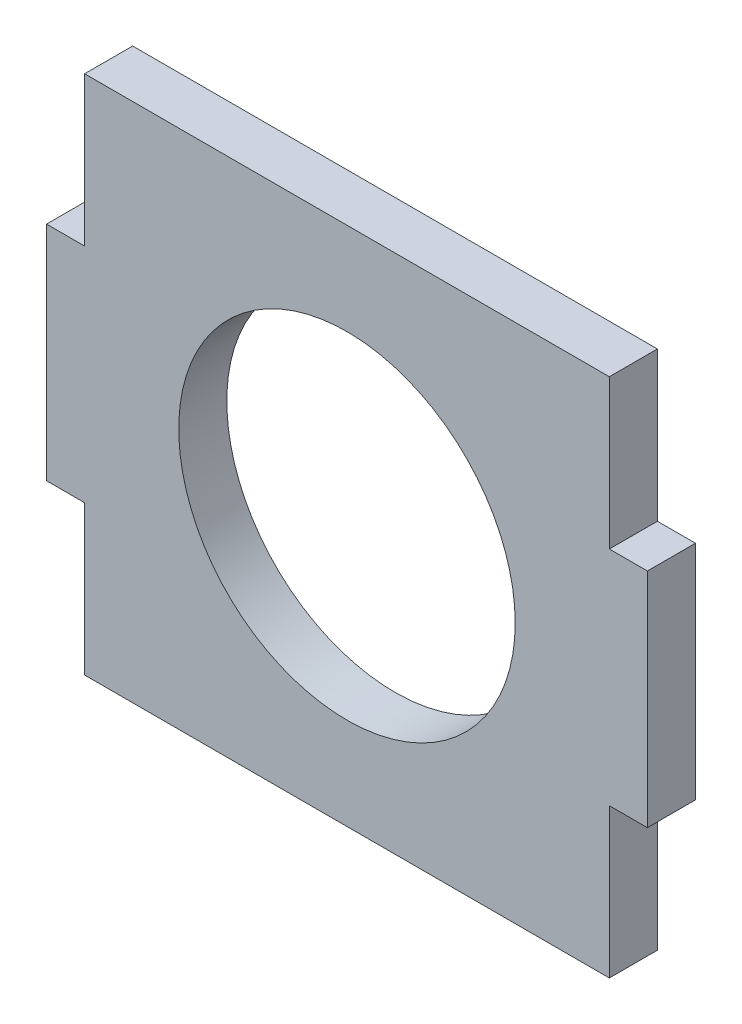
ISO-10303-21;
HEADER;
FILE_DESCRIPTION(('STEP AP214'),'2;1');
FILE_NAME('part.step','',(''),(''),'','','');
FILE_SCHEMA(('AUTOMOTIVE_DESIGN { 1 0 10303 214 1 1 1 1 }'));
ENDSEC;
DATA;
#1=APPLICATION_CONTEXT('core data for automotive mechanical design processes');
#2=APPLICATION_PROTOCOL_DEFINITION('international standard','automotive_design',2000,#1);
#3=PRODUCT_CONTEXT('',#1,'mechanical');
#4=PRODUCT('Part','Part','',(#3));
#5=PRODUCT_RELATED_PRODUCT_CATEGORY('part','',(#4));
#6=PRODUCT_DEFINITION_FORMATION('','',#4);
#7=PRODUCT_DEFINITION_CONTEXT('part definition',#1,'design');
#8=PRODUCT_DEFINITION('design','',#6,#7);
#9=PRODUCT_DEFINITION_SHAPE('','',#8);
#10=(LENGTH_UNIT() NAMED_UNIT(*) SI_UNIT(.MILLI.,.METRE.));
#11=(NAMED_UNIT(*) PLANE_ANGLE_UNIT() SI_UNIT($,.RADIAN.));
#12=(NAMED_UNIT(*) SI_UNIT($,.STERADIAN.) SOLID_ANGLE_UNIT());
#13=UNCERTAINTY_MEASURE_WITH_UNIT(LENGTH_MEASURE(1.E-05),#10,'distance_accuracy_value','');
#14=(GEOMETRIC_REPRESENTATION_CONTEXT(3) GLOBAL_UNCERTAINTY_ASSIGNED_CONTEXT((#13)) GLOBAL_UNIT_ASSIGNED_CONTEXT((#10,
#11,#12)) REPRESENTATION_CONTEXT('',''));
#15=CARTESIAN_POINT('',(0.,0.,0.));
#16=DIRECTION('',(0.,0.,1.));
#17=DIRECTION('',(1.,0.,0.));
#18=AXIS2_PLACEMENT_3D('',#15,#16,#17);
#19=CARTESIAN_POINT('',(-7.5,6.5,1.2));
#20=DIRECTION('',(1.,0.,0.));
#21=DIRECTION('',(0.,1.,0.));
#22=AXIS2_PLACEMENT_3D('',#19,#20,#21);
#23=PLANE('',#22);
#24=DIRECTION('',(0.,-1.,0.));
#25=VECTOR('',#24,1.);
#26=CARTESIAN_POINT('',(-7.5,6.5,1.2));
#27=LINE('',#26,#25);
#28=CARTESIAN_POINT('',(-7.5,2.775,1.2));
#29=VERTEX_POINT('',#28);
#30=CARTESIAN_POINT('',(-7.5,-2.775,1.2));
#31=VERTEX_POINT('',#30);
#32=EDGE_CURVE('E149',#29,#31,#27,.T.);
#33=ORIENTED_EDGE('',*,*,#32,.F.);
#34=DIRECTION('',(0.,0.,1.));
#35=VECTOR('',#34,1.);
#36=CARTESIAN_POINT('',(-7.5,2.775,-0.000999999999999916));
#37=LINE('',#36,#35);
#38=CARTESIAN_POINT('',(-7.5,2.775,0.));
#39=VERTEX_POINT('',#38);
#40=EDGE_CURVE('E136',#39,#29,#37,.T.);
#41=ORIENTED_EDGE('',*,*,#40,.F.);
#42=DIRECTION('',(0.,-1.,0.));
#43=VECTOR('',#42,1.);
#44=CARTESIAN_POINT('',(-7.5,6.5,0.));
#45=LINE('',#44,#43);
#46=CARTESIAN_POINT('',(-7.5,-2.775,0.));
#47=VERTEX_POINT('',#46);
#48=EDGE_CURVE('E148',#39,#47,#45,.T.);
#49=ORIENTED_EDGE('',*,*,#48,.T.);
#50=DIRECTION('',(0.,0.,1.));
#51=VECTOR('',#50,1.);
#52=CARTESIAN_POINT('',(-7.5,-2.775,-0.000999999999999916));
#53=LINE('',#52,#51);
#54=EDGE_CURVE('E399',#47,#31,#53,.T.);
#55=ORIENTED_EDGE('',*,*,#54,.T.);
#56=EDGE_LOOP('',(#33,#41,#49,#55));
#57=FACE_BOUND('',#56,.T.);
#58=ADVANCED_FACE('F41',(#57),#23,.F.);
#59=CARTESIAN_POINT('',(-7.5,-6.5,1.2));
#60=DIRECTION('',(0.,1.,0.));
#61=DIRECTION('',(0.,0.,1.));
#62=AXIS2_PLACEMENT_3D('',#59,#60,#61);
#63=PLANE('',#62);
#64=DIRECTION('',(1.,0.,0.));
#65=VECTOR('',#64,1.);
#66=CARTESIAN_POINT('',(-7.5,-6.5,1.2));
#67=LINE('',#66,#65);
#68=CARTESIAN_POINT('',(-6.55,-6.5,1.2));
#69=VERTEX_POINT('',#68);
#70=CARTESIAN_POINT('',(6.55,-6.5,1.2));
#71=VERTEX_POINT('',#70);
#72=EDGE_CURVE('E183',#69,#71,#67,.T.);
#73=ORIENTED_EDGE('',*,*,#72,.F.);
#74=DIRECTION('',(0.,0.,1.));
#75=VECTOR('',#74,1.);
#76=CARTESIAN_POINT('',(-6.55,-6.5,-0.000999999999999916));
#77=LINE('',#76,#75);
#78=CARTESIAN_POINT('',(-6.55,-6.5,0.));
#79=VERTEX_POINT('',#78);
#80=EDGE_CURVE('E398',#79,#69,#77,.T.);
#81=ORIENTED_EDGE('',*,*,#80,.F.);
#82=DIRECTION('',(1.,0.,0.));
#83=VECTOR('',#82,1.);
#84=CARTESIAN_POINT('',(-7.5,-6.5,0.));
#85=LINE('',#84,#83);
#86=CARTESIAN_POINT('',(6.55,-6.5,0.));
#87=VERTEX_POINT('',#86);
#88=EDGE_CURVE('E156',#79,#87,#85,.T.);
#89=ORIENTED_EDGE('',*,*,#88,.T.);
#90=DIRECTION('',(0.,0.,1.));
#91=VECTOR('',#90,1.);
#92=CARTESIAN_POINT('',(6.55,-6.5,-0.000999999999999916));
#93=LINE('',#92,#91);
#94=EDGE_CURVE('E415',#87,#71,#93,.T.);
#95=ORIENTED_EDGE('',*,*,#94,.T.);
#96=EDGE_LOOP('',(#73,#81,#89,#95));
#97=FACE_BOUND('',#96,.T.);
#98=ADVANCED_FACE('F217',(#97),#63,.F.);
#99=CARTESIAN_POINT('',(7.5,6.5,1.2));
#100=DIRECTION('',(-1.,0.,0.));
#101=DIRECTION('',(0.,0.,1.));
#102=AXIS2_PLACEMENT_3D('',#99,#100,#101);
#103=PLANE('',#102);
#104=DIRECTION('',(0.,1.,0.));
#105=VECTOR('',#104,1.);
#106=CARTESIAN_POINT('',(7.5,6.5,1.2));
#107=LINE('',#106,#105);
#108=CARTESIAN_POINT('',(7.5,-2.775,1.2));
#109=VERTEX_POINT('',#108);
#110=CARTESIAN_POINT('',(7.5,2.775,1.2));
#111=VERTEX_POINT('',#110);
#112=EDGE_CURVE('E50',#109,#111,#107,.T.);
#113=ORIENTED_EDGE('',*,*,#112,.F.);
#114=DIRECTION('',(0.,0.,1.));
#115=VECTOR('',#114,1.);
#116=CARTESIAN_POINT('',(7.5,-2.775,-0.000999999999999916));
#117=LINE('',#116,#115);
#118=CARTESIAN_POINT('',(7.5,-2.775,0.));
#119=VERTEX_POINT('',#118);
#120=EDGE_CURVE('E414',#119,#109,#117,.T.);
#121=ORIENTED_EDGE('',*,*,#120,.F.);
#122=DIRECTION('',(0.,1.,0.));
#123=VECTOR('',#122,1.);
#124=CARTESIAN_POINT('',(7.5,6.5,0.));
#125=LINE('',#124,#123);
#126=CARTESIAN_POINT('',(7.5,2.775,0.));
#127=VERTEX_POINT('',#126);
#128=EDGE_CURVE('E161',#119,#127,#125,.T.);
#129=ORIENTED_EDGE('',*,*,#128,.T.);
#130=DIRECTION('',(0.,0.,1.));
#131=VECTOR('',#130,1.);
#132=CARTESIAN_POINT('',(7.5,2.775,-0.000999999999999916));
#133=LINE('',#132,#131);
#134=EDGE_CURVE('E157',#127,#111,#133,.T.);
#135=ORIENTED_EDGE('',*,*,#134,.T.);
#136=EDGE_LOOP('',(#113,#121,#129,#135));
#137=FACE_BOUND('',#136,.T.);
#138=ADVANCED_FACE('F214',(#137),#103,.F.);
#139=CARTESIAN_POINT('',(-7.5,6.5,1.2));
#140=DIRECTION('',(0.,-1.,0.));
#141=DIRECTION('',(0.,0.,-1.));
#142=AXIS2_PLACEMENT_3D('',#139,#140,#141);
#143=PLANE('',#142);
#144=DIRECTION('',(-1.,0.,0.));
#145=VECTOR('',#144,1.);
#146=CARTESIAN_POINT('',(-7.5,6.5,0.));
#147=LINE('',#146,#145);
#148=CARTESIAN_POINT('',(6.55,6.5,0.));
#149=VERTEX_POINT('',#148);
#150=CARTESIAN_POINT('',(-6.55,6.5,0.));
#151=VERTEX_POINT('',#150);
#152=EDGE_CURVE('E44',#149,#151,#147,.T.);
#153=ORIENTED_EDGE('',*,*,#152,.T.);
#154=DIRECTION('',(0.,0.,1.));
#155=VECTOR('',#154,1.);
#156=CARTESIAN_POINT('',(-6.55,6.5,-0.000999999999999916));
#157=LINE('',#156,#155);
#158=CARTESIAN_POINT('',(-6.55,6.5,1.2));
#159=VERTEX_POINT('',#158);
#160=EDGE_CURVE('E143',#151,#159,#157,.T.);
#161=ORIENTED_EDGE('',*,*,#160,.T.);
#162=DIRECTION('',(-1.,0.,0.));
#163=VECTOR('',#162,1.);
#164=CARTESIAN_POINT('',(-7.5,6.5,1.2));
#165=LINE('',#164,#163);
#166=CARTESIAN_POINT('',(6.55,6.5,1.2));
#167=VERTEX_POINT('',#166);
#168=EDGE_CURVE('E11',#167,#159,#165,.T.);
#169=ORIENTED_EDGE('',*,*,#168,.F.);
#170=DIRECTION('',(0.,0.,1.));
#171=VECTOR('',#170,1.);
#172=CARTESIAN_POINT('',(6.55,6.5,-0.000999999999999916));
#173=LINE('',#172,#171);
#174=EDGE_CURVE('E192',#149,#167,#173,.T.);
#175=ORIENTED_EDGE('',*,*,#174,.F.);
#176=EDGE_LOOP('',(#153,#161,#169,#175));
#177=FACE_BOUND('',#176,.T.);
#178=ADVANCED_FACE('F216',(#177),#143,.F.);
#179=CARTESIAN_POINT('',(0.,0.,1.2));
#180=DIRECTION('',(0.,0.,1.));
#181=DIRECTION('',(1.,0.,0.));
#182=AXIS2_PLACEMENT_3D('',#179,#180,#181);
#183=PLANE('',#182);
#184=CARTESIAN_POINT('',(0.,0.,1.2));
#185=DIRECTION('',(0.,0.,1.));
#186=DIRECTION('',(1.,0.,0.));
#187=AXIS2_PLACEMENT_3D('',#184,#185,#186);
#188=CIRCLE('',#187,4.2);
#189=CARTESIAN_POINT('',(4.2,0.,1.2));
#190=VERTEX_POINT('',#189);
#191=EDGE_CURVE('E368',#190,#190,#188,.T.);
#192=ORIENTED_EDGE('',*,*,#191,.F.);
#193=EDGE_LOOP('',(#192));
#194=FACE_BOUND('',#193,.T.);
#195=DIRECTION('',(0.,1.,0.));
#196=VECTOR('',#195,1.);
#197=CARTESIAN_POINT('',(-6.55,6.5,1.2));
#198=LINE('',#197,#196);
#199=CARTESIAN_POINT('',(-6.55,2.775,1.2));
#200=VERTEX_POINT('',#199);
#201=EDGE_CURVE('E151',#200,#159,#198,.T.);
#202=ORIENTED_EDGE('',*,*,#201,.F.);
#203=DIRECTION('',(1.,0.,0.));
#204=VECTOR('',#203,1.);
#205=CARTESIAN_POINT('',(-7.5,2.775,1.2));
#206=LINE('',#205,#204);
#207=EDGE_CURVE('E375',#29,#200,#206,.T.);
#208=ORIENTED_EDGE('',*,*,#207,.F.);
#209=ORIENTED_EDGE('',*,*,#32,.T.);
#210=DIRECTION('',(-1.,0.,0.));
#211=VECTOR('',#210,1.);
#212=CARTESIAN_POINT('',(-7.5,-2.775,1.2));
#213=LINE('',#212,#211);
#214=CARTESIAN_POINT('',(-6.55,-2.775,1.2));
#215=VERTEX_POINT('',#214);
#216=EDGE_CURVE('E395',#215,#31,#213,.T.);
#217=ORIENTED_EDGE('',*,*,#216,.F.);
#218=DIRECTION('',(0.,1.,0.));
#219=VECTOR('',#218,1.);
#220=CARTESIAN_POINT('',(-6.55,-6.5,1.2));
#221=LINE('',#220,#219);
#222=EDGE_CURVE('E391',#69,#215,#221,.T.);
#223=ORIENTED_EDGE('',*,*,#222,.F.);
#224=ORIENTED_EDGE('',*,*,#72,.T.);
#225=DIRECTION('',(0.,-1.,0.));
#226=VECTOR('',#225,1.);
#227=CARTESIAN_POINT('',(6.55,-6.5,1.2));
#228=LINE('',#227,#226);
#229=CARTESIAN_POINT('',(6.55,-2.775,1.2));
#230=VERTEX_POINT('',#229);
#231=EDGE_CURVE('E410',#230,#71,#228,.T.);
#232=ORIENTED_EDGE('',*,*,#231,.F.);
#233=DIRECTION('',(-1.,0.,0.));
#234=VECTOR('',#233,1.);
#235=CARTESIAN_POINT('',(7.5,-2.775,1.2));
#236=LINE('',#235,#234);
#237=EDGE_CURVE('E206',#109,#230,#236,.T.);
#238=ORIENTED_EDGE('',*,*,#237,.F.);
#239=ORIENTED_EDGE('',*,*,#112,.T.);
#240=DIRECTION('',(1.,0.,0.));
#241=VECTOR('',#240,1.);
#242=CARTESIAN_POINT('',(7.5,2.775,1.2));
#243=LINE('',#242,#241);
#244=CARTESIAN_POINT('',(6.55,2.775,1.2));
#245=VERTEX_POINT('',#244);
#246=EDGE_CURVE('E203',#245,#111,#243,.T.);
#247=ORIENTED_EDGE('',*,*,#246,.F.);
#248=DIRECTION('',(0.,-1.,0.));
#249=VECTOR('',#248,1.);
#250=CARTESIAN_POINT('',(6.55,6.5,1.2));
#251=LINE('',#250,#249);
#252=EDGE_CURVE('E212',#167,#245,#251,.T.);
#253=ORIENTED_EDGE('',*,*,#252,.F.);
#254=ORIENTED_EDGE('',*,*,#168,.T.);
#255=EDGE_LOOP('',(#202,#208,#209,#217,#223,#224,#232,#238,#239,#247,#253,#254));
#256=FACE_BOUND('',#255,.T.);
#257=ADVANCED_FACE('F201',(#194,#256),#183,.T.);
#258=CARTESIAN_POINT('',(0.,0.,0.));
#259=DIRECTION('',(0.,0.,1.));
#260=DIRECTION('',(1.,0.,0.));
#261=AXIS2_PLACEMENT_3D('',#258,#259,#260);
#262=PLANE('',#261);
#263=CARTESIAN_POINT('',(0.,0.,0.));
#264=DIRECTION('',(0.,0.,1.));
#265=DIRECTION('',(1.,0.,0.));
#266=AXIS2_PLACEMENT_3D('',#263,#264,#265);
#267=CIRCLE('',#266,4.2);
#268=CARTESIAN_POINT('',(4.2,0.,0.));
#269=VERTEX_POINT('',#268);
#270=EDGE_CURVE('E371',#269,#269,#267,.F.);
#271=ORIENTED_EDGE('',*,*,#270,.F.);
#272=EDGE_LOOP('',(#271));
#273=FACE_BOUND('',#272,.T.);
#274=DIRECTION('',(-1.,0.,0.));
#275=VECTOR('',#274,1.);
#276=CARTESIAN_POINT('',(-7.5,2.775,0.));
#277=LINE('',#276,#275);
#278=CARTESIAN_POINT('',(-6.55,2.775,0.));
#279=VERTEX_POINT('',#278);
#280=EDGE_CURVE('E132',#279,#39,#277,.T.);
#281=ORIENTED_EDGE('',*,*,#280,.F.);
#282=DIRECTION('',(0.,-1.,0.));
#283=VECTOR('',#282,1.);
#284=CARTESIAN_POINT('',(-6.55,6.5,0.));
#285=LINE('',#284,#283);
#286=EDGE_CURVE('E58',#151,#279,#285,.T.);
#287=ORIENTED_EDGE('',*,*,#286,.F.);
#288=ORIENTED_EDGE('',*,*,#152,.F.);
#289=DIRECTION('',(0.,1.,0.));
#290=VECTOR('',#289,1.);
#291=CARTESIAN_POINT('',(6.55,6.5,0.));
#292=LINE('',#291,#290);
#293=CARTESIAN_POINT('',(6.55,2.775,0.));
#294=VERTEX_POINT('',#293);
#295=EDGE_CURVE('E426',#294,#149,#292,.T.);
#296=ORIENTED_EDGE('',*,*,#295,.F.);
#297=DIRECTION('',(-1.,0.,0.));
#298=VECTOR('',#297,1.);
#299=CARTESIAN_POINT('',(7.5,2.775,0.));
#300=LINE('',#299,#298);
#301=EDGE_CURVE('E429',#127,#294,#300,.T.);
#302=ORIENTED_EDGE('',*,*,#301,.F.);
#303=ORIENTED_EDGE('',*,*,#128,.F.);
#304=DIRECTION('',(1.,0.,0.));
#305=VECTOR('',#304,1.);
#306=CARTESIAN_POINT('',(7.5,-2.775,0.));
#307=LINE('',#306,#305);
#308=CARTESIAN_POINT('',(6.55,-2.775,0.));
#309=VERTEX_POINT('',#308);
#310=EDGE_CURVE('E419',#309,#119,#307,.T.);
#311=ORIENTED_EDGE('',*,*,#310,.F.);
#312=DIRECTION('',(0.,1.,0.));
#313=VECTOR('',#312,1.);
#314=CARTESIAN_POINT('',(6.55,-6.5,0.));
#315=LINE('',#314,#313);
#316=EDGE_CURVE('E402',#87,#309,#315,.T.);
#317=ORIENTED_EDGE('',*,*,#316,.F.);
#318=ORIENTED_EDGE('',*,*,#88,.F.);
#319=DIRECTION('',(0.,-1.,0.));
#320=VECTOR('',#319,1.);
#321=CARTESIAN_POINT('',(-6.55,-6.5,0.));
#322=LINE('',#321,#320);
#323=CARTESIAN_POINT('',(-6.55,-2.775,0.));
#324=VERTEX_POINT('',#323);
#325=EDGE_CURVE('E142',#324,#79,#322,.T.);
#326=ORIENTED_EDGE('',*,*,#325,.F.);
#327=DIRECTION('',(1.,0.,0.));
#328=VECTOR('',#327,1.);
#329=CARTESIAN_POINT('',(-7.5,-2.775,0.));
#330=LINE('',#329,#328);
#331=EDGE_CURVE('E66',#47,#324,#330,.T.);
#332=ORIENTED_EDGE('',*,*,#331,.F.);
#333=ORIENTED_EDGE('',*,*,#48,.F.);
#334=EDGE_LOOP('',(#281,#287,#288,#296,#302,#303,#311,#317,#318,#326,#332,#333));
#335=FACE_BOUND('',#334,.T.);
#336=ADVANCED_FACE('F153',(#273,#335),#262,.F.);
#337=CARTESIAN_POINT('',(7.5,2.775,-0.000999999999999916));
#338=DIRECTION('',(0.,-1.,0.));
#339=DIRECTION('',(0.,0.,-1.));
#340=AXIS2_PLACEMENT_3D('',#337,#338,#339);
#341=PLANE('',#340);
#342=ORIENTED_EDGE('',*,*,#301,.T.);
#343=DIRECTION('',(0.,0.,1.));
#344=VECTOR('',#343,1.);
#345=CARTESIAN_POINT('',(6.55,2.775,-0.000999999999999916));
#346=LINE('',#345,#344);
#347=EDGE_CURVE('E165',#294,#245,#346,.T.);
#348=ORIENTED_EDGE('',*,*,#347,.T.);
#349=ORIENTED_EDGE('',*,*,#246,.T.);
#350=ORIENTED_EDGE('',*,*,#134,.F.);
#351=EDGE_LOOP('',(#342,#348,#349,#350));
#352=FACE_BOUND('',#351,.T.);
#353=ADVANCED_FACE('F208',(#352),#341,.F.);
#354=CARTESIAN_POINT('',(6.55,6.5,-0.000999999999999916));
#355=DIRECTION('',(-1.,0.,0.));
#356=DIRECTION('',(0.,0.,1.));
#357=AXIS2_PLACEMENT_3D('',#354,#355,#356);
#358=PLANE('',#357);
#359=ORIENTED_EDGE('',*,*,#295,.T.);
#360=ORIENTED_EDGE('',*,*,#174,.T.);
#361=ORIENTED_EDGE('',*,*,#252,.T.);
#362=ORIENTED_EDGE('',*,*,#347,.F.);
#363=EDGE_LOOP('',(#359,#360,#361,#362));
#364=FACE_BOUND('',#363,.T.);
#365=ADVANCED_FACE('F264',(#364),#358,.F.);
#366=CARTESIAN_POINT('',(6.55,-6.5,-0.000999999999999916));
#367=DIRECTION('',(-1.,0.,0.));
#368=DIRECTION('',(0.,0.,1.));
#369=AXIS2_PLACEMENT_3D('',#366,#367,#368);
#370=PLANE('',#369);
#371=ORIENTED_EDGE('',*,*,#316,.T.);
#372=DIRECTION('',(0.,0.,1.));
#373=VECTOR('',#372,1.);
#374=CARTESIAN_POINT('',(6.55,-2.775,-0.000999999999999916));
#375=LINE('',#374,#373);
#376=EDGE_CURVE('E420',#309,#230,#375,.T.);
#377=ORIENTED_EDGE('',*,*,#376,.T.);
#378=ORIENTED_EDGE('',*,*,#231,.T.);
#379=ORIENTED_EDGE('',*,*,#94,.F.);
#380=EDGE_LOOP('',(#371,#377,#378,#379));
#381=FACE_BOUND('',#380,.T.);
#382=ADVANCED_FACE('F272',(#381),#370,.F.);
#383=CARTESIAN_POINT('',(7.5,-2.775,-0.000999999999999916));
#384=DIRECTION('',(0.,1.,0.));
#385=DIRECTION('',(0.,0.,1.));
#386=AXIS2_PLACEMENT_3D('',#383,#384,#385);
#387=PLANE('',#386);
#388=ORIENTED_EDGE('',*,*,#310,.T.);
#389=ORIENTED_EDGE('',*,*,#120,.T.);
#390=ORIENTED_EDGE('',*,*,#237,.T.);
#391=ORIENTED_EDGE('',*,*,#376,.F.);
#392=EDGE_LOOP('',(#388,#389,#390,#391));
#393=FACE_BOUND('',#392,.T.);
#394=ADVANCED_FACE('F281',(#393),#387,.F.);
#395=CARTESIAN_POINT('',(-7.5,-2.775,-0.000999999999999916));
#396=DIRECTION('',(0.,1.,0.));
#397=DIRECTION('',(0.,0.,1.));
#398=AXIS2_PLACEMENT_3D('',#395,#396,#397);
#399=PLANE('',#398);
#400=ORIENTED_EDGE('',*,*,#331,.T.);
#401=DIRECTION('',(0.,0.,1.));
#402=VECTOR('',#401,1.);
#403=CARTESIAN_POINT('',(-6.55,-2.775,-0.000999999999999916));
#404=LINE('',#403,#402);
#405=EDGE_CURVE('E403',#324,#215,#404,.T.);
#406=ORIENTED_EDGE('',*,*,#405,.T.);
#407=ORIENTED_EDGE('',*,*,#216,.T.);
#408=ORIENTED_EDGE('',*,*,#54,.F.);
#409=EDGE_LOOP('',(#400,#406,#407,#408));
#410=FACE_BOUND('',#409,.T.);
#411=ADVANCED_FACE('F290',(#410),#399,.F.);
#412=CARTESIAN_POINT('',(-6.55,-6.5,-0.000999999999999916));
#413=DIRECTION('',(1.,0.,0.));
#414=DIRECTION('',(0.,1.,0.));
#415=AXIS2_PLACEMENT_3D('',#412,#413,#414);
#416=PLANE('',#415);
#417=ORIENTED_EDGE('',*,*,#325,.T.);
#418=ORIENTED_EDGE('',*,*,#80,.T.);
#419=ORIENTED_EDGE('',*,*,#222,.T.);
#420=ORIENTED_EDGE('',*,*,#405,.F.);
#421=EDGE_LOOP('',(#417,#418,#419,#420));
#422=FACE_BOUND('',#421,.T.);
#423=ADVANCED_FACE('F299',(#422),#416,.F.);
#424=CARTESIAN_POINT('',(-6.55,6.5,-0.000999999999999916));
#425=DIRECTION('',(1.,0.,0.));
#426=DIRECTION('',(0.,1.,0.));
#427=AXIS2_PLACEMENT_3D('',#424,#425,#426);
#428=PLANE('',#427);
#429=ORIENTED_EDGE('',*,*,#286,.T.);
#430=DIRECTION('',(0.,0.,1.));
#431=VECTOR('',#430,1.);
#432=CARTESIAN_POINT('',(-6.55,2.775,-0.000999999999999916));
#433=LINE('',#432,#431);
#434=EDGE_CURVE('E138',#279,#200,#433,.T.);
#435=ORIENTED_EDGE('',*,*,#434,.T.);
#436=ORIENTED_EDGE('',*,*,#201,.T.);
#437=ORIENTED_EDGE('',*,*,#160,.F.);
#438=EDGE_LOOP('',(#429,#435,#436,#437));
#439=FACE_BOUND('',#438,.T.);
#440=ADVANCED_FACE('F307',(#439),#428,.F.);
#441=CARTESIAN_POINT('',(-7.5,2.775,-0.000999999999999916));
#442=DIRECTION('',(0.,-1.,0.));
#443=DIRECTION('',(0.,0.,-1.));
#444=AXIS2_PLACEMENT_3D('',#441,#442,#443);
#445=PLANE('',#444);
#446=ORIENTED_EDGE('',*,*,#280,.T.);
#447=ORIENTED_EDGE('',*,*,#40,.T.);
#448=ORIENTED_EDGE('',*,*,#207,.T.);
#449=ORIENTED_EDGE('',*,*,#434,.F.);
#450=EDGE_LOOP('',(#446,#447,#448,#449));
#451=FACE_BOUND('',#450,.T.);
#452=ADVANCED_FACE('F134',(#451),#445,.F.);
#453=CARTESIAN_POINT('',(0.,0.,-0.000999999999999916));
#454=DIRECTION('',(0.,0.,1.));
#455=DIRECTION('',(1.,0.,0.));
#456=AXIS2_PLACEMENT_3D('',#453,#454,#455);
#457=CYLINDRICAL_SURFACE('',#456,4.2);
#458=ORIENTED_EDGE('',*,*,#191,.T.);
#459=EDGE_LOOP('',(#458));
#460=FACE_BOUND('',#459,.T.);
#461=ORIENTED_EDGE('',*,*,#270,.T.);
#462=EDGE_LOOP('',(#461));
#463=FACE_BOUND('',#462,.T.);
#464=ADVANCED_FACE('F322',(#460,#463),#457,.F.);
#465=CLOSED_SHELL('',(#58,#98,#138,#178,#257,#336,#353,#365,#382,#394,#411,#423,#440,#452,#464));
#466=MANIFOLD_SOLID_BREP('B2',#465);
#467=ADVANCED_BREP_SHAPE_REPRESENTATION('',(#18,#466),#14);
#468=SHAPE_DEFINITION_REPRESENTATION(#9,#467);
ENDSEC;
END-ISO-10303-21;
